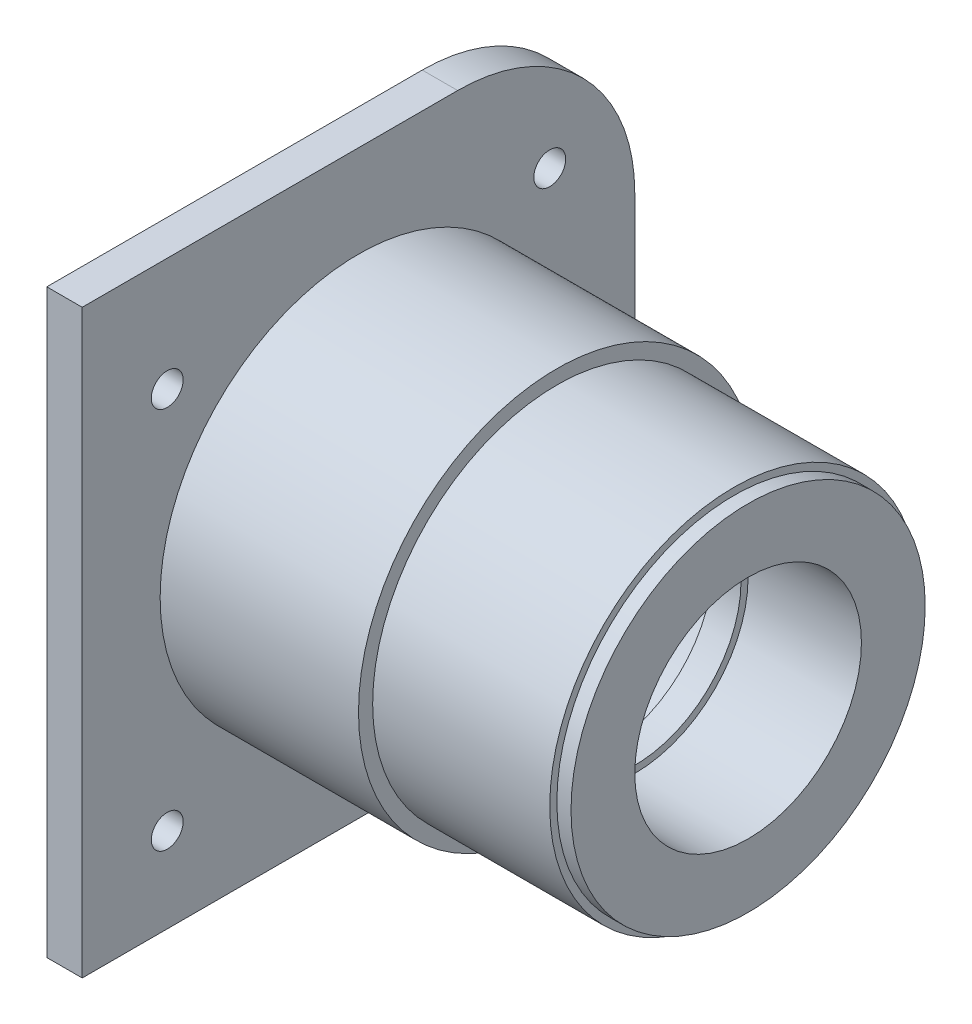
ISO-10303-21;
HEADER;
FILE_DESCRIPTION(('STEP AP214'),'2;1');
FILE_NAME('part.step','',(''),(''),'','','');
FILE_SCHEMA(('AUTOMOTIVE_DESIGN { 1 0 10303 214 1 1 1 1 }'));
ENDSEC;
DATA;
#1=APPLICATION_CONTEXT('core data for automotive mechanical design processes');
#2=APPLICATION_PROTOCOL_DEFINITION('international standard','automotive_design',2000,#1);
#3=PRODUCT_CONTEXT('',#1,'mechanical');
#4=PRODUCT('Part','Part','',(#3));
#5=PRODUCT_RELATED_PRODUCT_CATEGORY('part','',(#4));
#6=PRODUCT_DEFINITION_FORMATION('','',#4);
#7=PRODUCT_DEFINITION_CONTEXT('part definition',#1,'design');
#8=PRODUCT_DEFINITION('design','',#6,#7);
#9=PRODUCT_DEFINITION_SHAPE('','',#8);
#10=(LENGTH_UNIT() NAMED_UNIT(*) SI_UNIT(.MILLI.,.METRE.));
#11=(NAMED_UNIT(*) PLANE_ANGLE_UNIT() SI_UNIT($,.RADIAN.));
#12=(NAMED_UNIT(*) SI_UNIT($,.STERADIAN.) SOLID_ANGLE_UNIT());
#13=UNCERTAINTY_MEASURE_WITH_UNIT(LENGTH_MEASURE(1.E-05),#10,'distance_accuracy_value','');
#14=(GEOMETRIC_REPRESENTATION_CONTEXT(3) GLOBAL_UNCERTAINTY_ASSIGNED_CONTEXT((#13)) GLOBAL_UNIT_ASSIGNED_CONTEXT((#10,
#11,#12)) REPRESENTATION_CONTEXT('',''));
#15=CARTESIAN_POINT('',(0.,0.,0.));
#16=DIRECTION('',(0.,0.,1.));
#17=DIRECTION('',(1.,0.,0.));
#18=AXIS2_PLACEMENT_3D('',#15,#16,#17);
#19=CARTESIAN_POINT('',(-5.,-21.,-21.));
#20=DIRECTION('',(0.,1.,0.));
#21=DIRECTION('',(0.,0.,1.));
#22=AXIS2_PLACEMENT_3D('',#19,#20,#21);
#23=PLANE('',#22);
#24=DIRECTION('',(0.,0.,1.));
#25=VECTOR('',#24,1.);
#26=CARTESIAN_POINT('',(0.,-21.,-21.));
#27=LINE('',#26,#25);
#28=CARTESIAN_POINT('',(0.,-21.,-18.));
#29=VERTEX_POINT('',#28);
#30=CARTESIAN_POINT('',(0.,-21.,0.));
#31=VERTEX_POINT('',#30);
#32=EDGE_CURVE('E253',#29,#31,#27,.T.);
#33=ORIENTED_EDGE('',*,*,#32,.F.);
#34=DIRECTION('',(1.,0.,0.));
#35=VECTOR('',#34,1.);
#36=CARTESIAN_POINT('',(-5.,-21.,-18.));
#37=LINE('',#36,#35);
#38=CARTESIAN_POINT('',(-5.,-21.,-18.));
#39=VERTEX_POINT('',#38);
#40=EDGE_CURVE('E172',#39,#29,#37,.T.);
#41=ORIENTED_EDGE('',*,*,#40,.F.);
#42=DIRECTION('',(0.,0.,1.));
#43=VECTOR('',#42,1.);
#44=CARTESIAN_POINT('',(-5.,-21.,-21.));
#45=LINE('',#44,#43);
#46=CARTESIAN_POINT('',(-5.,-21.,18.));
#47=VERTEX_POINT('',#46);
#48=EDGE_CURVE('E243',#39,#47,#45,.T.);
#49=ORIENTED_EDGE('',*,*,#48,.T.);
#50=DIRECTION('',(1.,0.,0.));
#51=VECTOR('',#50,1.);
#52=CARTESIAN_POINT('',(-5.,-21.,18.));
#53=LINE('',#52,#51);
#54=CARTESIAN_POINT('',(0.,-21.,18.));
#55=VERTEX_POINT('',#54);
#56=EDGE_CURVE('E185',#47,#55,#53,.T.);
#57=ORIENTED_EDGE('',*,*,#56,.T.);
#58=EDGE_CURVE('E248',#31,#55,#27,.T.);
#59=ORIENTED_EDGE('',*,*,#58,.F.);
#60=EDGE_LOOP('',(#33,#41,#49,#57,#59));
#61=FACE_BOUND('',#60,.T.);
#62=ADVANCED_FACE('F36',(#61),#23,.T.);
#63=CARTESIAN_POINT('',(-5.,-21.,-21.));
#64=DIRECTION('',(0.,0.,1.));
#65=DIRECTION('',(0.,-1.,0.));
#66=AXIS2_PLACEMENT_3D('',#63,#64,#65);
#67=PLANE('',#66);
#68=DIRECTION('',(0.,-1.,0.));
#69=VECTOR('',#68,1.);
#70=CARTESIAN_POINT('',(-5.,-21.,-21.));
#71=LINE('',#70,#69);
#72=CARTESIAN_POINT('',(-5.,18.,-21.));
#73=VERTEX_POINT('',#72);
#74=CARTESIAN_POINT('',(-5.,-18.,-21.));
#75=VERTEX_POINT('',#74);
#76=EDGE_CURVE('E168',#73,#75,#71,.T.);
#77=ORIENTED_EDGE('',*,*,#76,.T.);
#78=DIRECTION('',(1.,0.,0.));
#79=VECTOR('',#78,1.);
#80=CARTESIAN_POINT('',(-5.,-18.,-21.));
#81=LINE('',#80,#79);
#82=CARTESIAN_POINT('',(0.,-18.,-21.));
#83=VERTEX_POINT('',#82);
#84=EDGE_CURVE('E165',#75,#83,#81,.T.);
#85=ORIENTED_EDGE('',*,*,#84,.T.);
#86=DIRECTION('',(0.,-1.,0.));
#87=VECTOR('',#86,1.);
#88=CARTESIAN_POINT('',(0.,-21.,-21.));
#89=LINE('',#88,#87);
#90=CARTESIAN_POINT('',(0.,0.,-21.));
#91=VERTEX_POINT('',#90);
#92=EDGE_CURVE('E150',#91,#83,#89,.T.);
#93=ORIENTED_EDGE('',*,*,#92,.F.);
#94=CARTESIAN_POINT('',(0.,18.,-21.));
#95=VERTEX_POINT('',#94);
#96=EDGE_CURVE('E161',#95,#91,#89,.T.);
#97=ORIENTED_EDGE('',*,*,#96,.F.);
#98=DIRECTION('',(1.,0.,0.));
#99=VECTOR('',#98,1.);
#100=CARTESIAN_POINT('',(-5.,18.,-21.));
#101=LINE('',#100,#99);
#102=EDGE_CURVE('E211',#73,#95,#101,.T.);
#103=ORIENTED_EDGE('',*,*,#102,.F.);
#104=EDGE_LOOP('',(#77,#85,#93,#97,#103));
#105=FACE_BOUND('',#104,.T.);
#106=ADVANCED_FACE('F166',(#105),#67,.T.);
#107=CARTESIAN_POINT('',(0.,28.,0.));
#108=DIRECTION('',(1.,0.,0.));
#109=DIRECTION('',(0.,0.,-1.));
#110=AXIS2_PLACEMENT_3D('',#107,#108,#109);
#111=PLANE('',#110);
#112=DIRECTION('',(0.,0.707106781186546,-0.707106781186549));
#113=VECTOR('',#112,1.);
#114=CARTESIAN_POINT('',(0.,-18.,-21.));
#115=LINE('',#114,#113);
#116=EDGE_CURVE('E154',#29,#83,#115,.T.);
#117=ORIENTED_EDGE('',*,*,#116,.F.);
#118=ORIENTED_EDGE('',*,*,#32,.T.);
#119=CARTESIAN_POINT('',(0.,0.,0.));
#120=DIRECTION('',(-1.,0.,0.));
#121=DIRECTION('',(0.,0.,1.));
#122=AXIS2_PLACEMENT_3D('',#119,#120,#121);
#123=CIRCLE('',#122,21.);
#124=EDGE_CURVE('E157',#91,#31,#123,.T.);
#125=ORIENTED_EDGE('',*,*,#124,.F.);
#126=ORIENTED_EDGE('',*,*,#92,.T.);
#127=EDGE_LOOP('',(#117,#118,#125,#126));
#128=FACE_BOUND('',#127,.T.);
#129=ADVANCED_FACE('F152',(#128),#111,.F.);
#130=CARTESIAN_POINT('',(-5.,-21.,21.));
#131=DIRECTION('',(0.,0.,-1.));
#132=DIRECTION('',(0.,1.,0.));
#133=AXIS2_PLACEMENT_3D('',#130,#131,#132);
#134=PLANE('',#133);
#135=DIRECTION('',(0.,1.,0.));
#136=VECTOR('',#135,1.);
#137=CARTESIAN_POINT('',(0.,-21.,21.));
#138=LINE('',#137,#136);
#139=CARTESIAN_POINT('',(0.,-18.,21.));
#140=VERTEX_POINT('',#139);
#141=CARTESIAN_POINT('',(0.,0.,21.));
#142=VERTEX_POINT('',#141);
#143=EDGE_CURVE('E246',#140,#142,#138,.T.);
#144=ORIENTED_EDGE('',*,*,#143,.F.);
#145=DIRECTION('',(1.,0.,0.));
#146=VECTOR('',#145,1.);
#147=CARTESIAN_POINT('',(-5.,-18.,21.));
#148=LINE('',#147,#146);
#149=CARTESIAN_POINT('',(-5.,-18.,21.));
#150=VERTEX_POINT('',#149);
#151=EDGE_CURVE('E189',#150,#140,#148,.T.);
#152=ORIENTED_EDGE('',*,*,#151,.F.);
#153=DIRECTION('',(0.,1.,0.));
#154=VECTOR('',#153,1.);
#155=CARTESIAN_POINT('',(-5.,-21.,21.));
#156=LINE('',#155,#154);
#157=CARTESIAN_POINT('',(-5.,18.,21.));
#158=VERTEX_POINT('',#157);
#159=EDGE_CURVE('E238',#150,#158,#156,.T.);
#160=ORIENTED_EDGE('',*,*,#159,.T.);
#161=DIRECTION('',(1.,0.,0.));
#162=VECTOR('',#161,1.);
#163=CARTESIAN_POINT('',(-5.,18.,21.));
#164=LINE('',#163,#162);
#165=CARTESIAN_POINT('',(0.,18.,21.));
#166=VERTEX_POINT('',#165);
#167=EDGE_CURVE('E196',#158,#166,#164,.T.);
#168=ORIENTED_EDGE('',*,*,#167,.T.);
#169=EDGE_CURVE('E249',#142,#166,#138,.T.);
#170=ORIENTED_EDGE('',*,*,#169,.F.);
#171=EDGE_LOOP('',(#144,#152,#160,#168,#170));
#172=FACE_BOUND('',#171,.T.);
#173=ADVANCED_FACE('F380',(#172),#134,.T.);
#174=DIRECTION('',(0.,-0.707106781186548,-0.707106781186547));
#175=VECTOR('',#174,1.);
#176=CARTESIAN_POINT('',(0.,-18.,21.));
#177=LINE('',#176,#175);
#178=EDGE_CURVE('E181',#140,#55,#177,.T.);
#179=ORIENTED_EDGE('',*,*,#178,.F.);
#180=ORIENTED_EDGE('',*,*,#143,.T.);
#181=EDGE_CURVE('E310',#31,#142,#123,.T.);
#182=ORIENTED_EDGE('',*,*,#181,.F.);
#183=ORIENTED_EDGE('',*,*,#58,.T.);
#184=EDGE_LOOP('',(#179,#180,#182,#183));
#185=FACE_BOUND('',#184,.T.);
#186=ADVANCED_FACE('F378',(#185),#111,.F.);
#187=CARTESIAN_POINT('',(-5.,21.,-21.));
#188=DIRECTION('',(0.,-1.,0.));
#189=DIRECTION('',(0.,0.,-1.));
#190=AXIS2_PLACEMENT_3D('',#187,#188,#189);
#191=PLANE('',#190);
#192=DIRECTION('',(0.,0.,-1.));
#193=VECTOR('',#192,1.);
#194=CARTESIAN_POINT('',(0.,21.,-21.));
#195=LINE('',#194,#193);
#196=CARTESIAN_POINT('',(0.,21.,18.));
#197=VERTEX_POINT('',#196);
#198=CARTESIAN_POINT('',(0.,21.,0.));
#199=VERTEX_POINT('',#198);
#200=EDGE_CURVE('E250',#197,#199,#195,.T.);
#201=ORIENTED_EDGE('',*,*,#200,.F.);
#202=DIRECTION('',(1.,0.,0.));
#203=VECTOR('',#202,1.);
#204=CARTESIAN_POINT('',(-5.,21.,18.));
#205=LINE('',#204,#203);
#206=CARTESIAN_POINT('',(-5.,21.,18.));
#207=VERTEX_POINT('',#206);
#208=EDGE_CURVE('E200',#207,#197,#205,.T.);
#209=ORIENTED_EDGE('',*,*,#208,.F.);
#210=DIRECTION('',(0.,0.,-1.));
#211=VECTOR('',#210,1.);
#212=CARTESIAN_POINT('',(-5.,21.,-21.));
#213=LINE('',#212,#211);
#214=CARTESIAN_POINT('',(-5.,21.,-18.));
#215=VERTEX_POINT('',#214);
#216=EDGE_CURVE('E240',#207,#215,#213,.T.);
#217=ORIENTED_EDGE('',*,*,#216,.T.);
#218=DIRECTION('',(1.,0.,0.));
#219=VECTOR('',#218,1.);
#220=CARTESIAN_POINT('',(-5.,21.,-18.));
#221=LINE('',#220,#219);
#222=CARTESIAN_POINT('',(0.,21.,-18.));
#223=VERTEX_POINT('',#222);
#224=EDGE_CURVE('E207',#215,#223,#221,.T.);
#225=ORIENTED_EDGE('',*,*,#224,.T.);
#226=EDGE_CURVE('E251',#199,#223,#195,.T.);
#227=ORIENTED_EDGE('',*,*,#226,.F.);
#228=EDGE_LOOP('',(#201,#209,#217,#225,#227));
#229=FACE_BOUND('',#228,.T.);
#230=ADVANCED_FACE('F374',(#229),#191,.T.);
#231=DIRECTION('',(0.,-0.707106781186547,0.707106781186547));
#232=VECTOR('',#231,1.);
#233=CARTESIAN_POINT('',(0.,18.,21.));
#234=LINE('',#233,#232);
#235=EDGE_CURVE('E192',#197,#166,#234,.T.);
#236=ORIENTED_EDGE('',*,*,#235,.F.);
#237=ORIENTED_EDGE('',*,*,#200,.T.);
#238=EDGE_CURVE('E162',#142,#199,#123,.T.);
#239=ORIENTED_EDGE('',*,*,#238,.F.);
#240=ORIENTED_EDGE('',*,*,#169,.T.);
#241=EDGE_LOOP('',(#236,#237,#239,#240));
#242=FACE_BOUND('',#241,.T.);
#243=ADVANCED_FACE('F377',(#242),#111,.F.);
#244=DIRECTION('',(0.,0.707106781186548,0.707106781186547));
#245=VECTOR('',#244,1.);
#246=CARTESIAN_POINT('',(0.,18.,-21.));
#247=LINE('',#246,#245);
#248=EDGE_CURVE('E203',#95,#223,#247,.T.);
#249=ORIENTED_EDGE('',*,*,#248,.F.);
#250=ORIENTED_EDGE('',*,*,#96,.T.);
#251=EDGE_CURVE('E313',#199,#91,#123,.T.);
#252=ORIENTED_EDGE('',*,*,#251,.F.);
#253=ORIENTED_EDGE('',*,*,#226,.T.);
#254=EDGE_LOOP('',(#249,#250,#252,#253));
#255=FACE_BOUND('',#254,.T.);
#256=ADVANCED_FACE('F386',(#255),#111,.F.);
#257=CARTESIAN_POINT('',(-5.,0.,0.));
#258=DIRECTION('',(1.,0.,0.));
#259=DIRECTION('',(0.,0.,-1.));
#260=AXIS2_PLACEMENT_3D('',#257,#258,#259);
#261=PLANE('',#260);
#262=ORIENTED_EDGE('',*,*,#48,.F.);
#263=DIRECTION('',(0.,0.707106781186546,-0.707106781186549));
#264=VECTOR('',#263,1.);
#265=CARTESIAN_POINT('',(-5.,-18.,-21.));
#266=LINE('',#265,#264);
#267=EDGE_CURVE('E173',#39,#75,#266,.T.);
#268=ORIENTED_EDGE('',*,*,#267,.T.);
#269=ORIENTED_EDGE('',*,*,#76,.F.);
#270=DIRECTION('',(0.,0.707106781186548,0.707106781186547));
#271=VECTOR('',#270,1.);
#272=CARTESIAN_POINT('',(-5.,18.,-21.));
#273=LINE('',#272,#271);
#274=EDGE_CURVE('E204',#73,#215,#273,.T.);
#275=ORIENTED_EDGE('',*,*,#274,.T.);
#276=ORIENTED_EDGE('',*,*,#216,.F.);
#277=DIRECTION('',(0.,-0.707106781186547,0.707106781186547));
#278=VECTOR('',#277,1.);
#279=CARTESIAN_POINT('',(-5.,18.,21.));
#280=LINE('',#279,#278);
#281=EDGE_CURVE('E193',#207,#158,#280,.T.);
#282=ORIENTED_EDGE('',*,*,#281,.T.);
#283=ORIENTED_EDGE('',*,*,#159,.F.);
#284=DIRECTION('',(0.,-0.707106781186548,-0.707106781186547));
#285=VECTOR('',#284,1.);
#286=CARTESIAN_POINT('',(-5.,-18.,21.));
#287=LINE('',#286,#285);
#288=EDGE_CURVE('E182',#150,#47,#287,.T.);
#289=ORIENTED_EDGE('',*,*,#288,.T.);
#290=EDGE_LOOP('',(#262,#268,#269,#275,#276,#282,#283,#289));
#291=FACE_BOUND('',#290,.T.);
#292=DIRECTION('',(0.,-1.,0.));
#293=VECTOR('',#292,1.);
#294=CARTESIAN_POINT('',(-5.,-41.,-39.));
#295=LINE('',#294,#293);
#296=CARTESIAN_POINT('',(-5.,16.,-39.));
#297=VERTEX_POINT('',#296);
#298=CARTESIAN_POINT('',(-5.,-16.,-39.));
#299=VERTEX_POINT('',#298);
#300=EDGE_CURVE('E262',#297,#299,#295,.T.);
#301=ORIENTED_EDGE('',*,*,#300,.T.);
#302=CARTESIAN_POINT('',(-5.,-16.,-14.));
#303=DIRECTION('',(1.,0.,0.));
#304=DIRECTION('',(0.,0.,-1.));
#305=AXIS2_PLACEMENT_3D('',#302,#303,#304);
#306=CIRCLE('',#305,25.);
#307=CARTESIAN_POINT('',(-5.,-41.,-14.));
#308=VERTEX_POINT('',#307);
#309=EDGE_CURVE('E44',#299,#308,#306,.F.);
#310=ORIENTED_EDGE('',*,*,#309,.T.);
#311=DIRECTION('',(0.,0.,1.));
#312=VECTOR('',#311,1.);
#313=CARTESIAN_POINT('',(-5.,-41.,-39.));
#314=LINE('',#313,#312);
#315=CARTESIAN_POINT('',(-5.,-41.,39.));
#316=VERTEX_POINT('',#315);
#317=EDGE_CURVE('E264',#308,#316,#314,.T.);
#318=ORIENTED_EDGE('',*,*,#317,.T.);
#319=DIRECTION('',(0.,1.,0.));
#320=VECTOR('',#319,1.);
#321=CARTESIAN_POINT('',(-5.,-41.,39.));
#322=LINE('',#321,#320);
#323=CARTESIAN_POINT('',(-5.,41.,39.));
#324=VERTEX_POINT('',#323);
#325=EDGE_CURVE('E256',#316,#324,#322,.T.);
#326=ORIENTED_EDGE('',*,*,#325,.T.);
#327=DIRECTION('',(0.,0.,-1.));
#328=VECTOR('',#327,1.);
#329=CARTESIAN_POINT('',(-5.,41.,-39.));
#330=LINE('',#329,#328);
#331=CARTESIAN_POINT('',(-5.,41.,-14.));
#332=VERTEX_POINT('',#331);
#333=EDGE_CURVE('E259',#324,#332,#330,.T.);
#334=ORIENTED_EDGE('',*,*,#333,.T.);
#335=CARTESIAN_POINT('',(-5.,16.,-14.));
#336=DIRECTION('',(1.,0.,0.));
#337=DIRECTION('',(0.,0.,-1.));
#338=AXIS2_PLACEMENT_3D('',#335,#336,#337);
#339=CIRCLE('',#338,25.);
#340=EDGE_CURVE('E326',#332,#297,#339,.F.);
#341=ORIENTED_EDGE('',*,*,#340,.T.);
#342=EDGE_LOOP('',(#301,#310,#318,#326,#334,#341));
#343=FACE_BOUND('',#342,.T.);
#344=CARTESIAN_POINT('',(-5.,-29.,-27.));
#345=DIRECTION('',(-1.,0.,0.));
#346=DIRECTION('',(0.,0.,1.));
#347=AXIS2_PLACEMENT_3D('',#344,#345,#346);
#348=CIRCLE('',#347,2.24999999999999);
#349=CARTESIAN_POINT('',(-5.,-29.,-24.75));
#350=VERTEX_POINT('',#349);
#351=EDGE_CURVE('E232',#350,#350,#348,.T.);
#352=ORIENTED_EDGE('',*,*,#351,.F.);
#353=EDGE_LOOP('',(#352));
#354=FACE_BOUND('',#353,.T.);
#355=CARTESIAN_POINT('',(-5.,-29.,27.));
#356=DIRECTION('',(-1.,0.,0.));
#357=DIRECTION('',(0.,0.,1.));
#358=AXIS2_PLACEMENT_3D('',#355,#356,#357);
#359=CIRCLE('',#358,2.24999999999999);
#360=CARTESIAN_POINT('',(-5.,-29.,29.25));
#361=VERTEX_POINT('',#360);
#362=EDGE_CURVE('E226',#361,#361,#359,.T.);
#363=ORIENTED_EDGE('',*,*,#362,.F.);
#364=EDGE_LOOP('',(#363));
#365=FACE_BOUND('',#364,.T.);
#366=CARTESIAN_POINT('',(-5.,25.,27.));
#367=DIRECTION('',(-1.,0.,0.));
#368=DIRECTION('',(0.,0.,1.));
#369=AXIS2_PLACEMENT_3D('',#366,#367,#368);
#370=CIRCLE('',#369,2.24999999999999);
#371=CARTESIAN_POINT('',(-5.,25.,29.25));
#372=VERTEX_POINT('',#371);
#373=EDGE_CURVE('E220',#372,#372,#370,.T.);
#374=ORIENTED_EDGE('',*,*,#373,.F.);
#375=EDGE_LOOP('',(#374));
#376=FACE_BOUND('',#375,.T.);
#377=CARTESIAN_POINT('',(-5.,25.,-27.));
#378=DIRECTION('',(-1.,0.,0.));
#379=DIRECTION('',(0.,0.,1.));
#380=AXIS2_PLACEMENT_3D('',#377,#378,#379);
#381=CIRCLE('',#380,2.24999999999999);
#382=CARTESIAN_POINT('',(-5.,25.,-24.75));
#383=VERTEX_POINT('',#382);
#384=EDGE_CURVE('E214',#383,#383,#381,.T.);
#385=ORIENTED_EDGE('',*,*,#384,.F.);
#386=EDGE_LOOP('',(#385));
#387=FACE_BOUND('',#386,.T.);
#388=ADVANCED_FACE('F330',(#291,#343,#354,#365,#376,#387),#261,.F.);
#389=CARTESIAN_POINT('',(55.,16.,0.));
#390=DIRECTION('',(-1.,0.,0.));
#391=DIRECTION('',(0.,0.,1.));
#392=AXIS2_PLACEMENT_3D('',#389,#390,#391);
#393=PLANE('',#392);
#394=CARTESIAN_POINT('',(55.,0.,0.));
#395=DIRECTION('',(-1.,0.,0.));
#396=DIRECTION('',(0.,0.,1.));
#397=AXIS2_PLACEMENT_3D('',#394,#395,#396);
#398=CIRCLE('',#397,16.);
#399=CARTESIAN_POINT('',(55.,0.,16.));
#400=VERTEX_POINT('',#399);
#401=EDGE_CURVE('E295',#400,#400,#398,.T.);
#402=ORIENTED_EDGE('',*,*,#401,.T.);
#403=EDGE_LOOP('',(#402));
#404=FACE_BOUND('',#403,.T.);
#405=CARTESIAN_POINT('',(55.,0.,0.));
#406=DIRECTION('',(1.,0.,0.));
#407=DIRECTION('',(0.,0.,-1.));
#408=AXIS2_PLACEMENT_3D('',#405,#406,#407);
#409=CIRCLE('',#408,25.);
#410=CARTESIAN_POINT('',(55.,0.,-25.));
#411=VERTEX_POINT('',#410);
#412=EDGE_CURVE('E280',#411,#411,#409,.T.);
#413=ORIENTED_EDGE('',*,*,#412,.T.);
#414=EDGE_LOOP('',(#413));
#415=FACE_BOUND('',#414,.T.);
#416=ADVANCED_FACE('F385',(#404,#415),#393,.F.);
#417=CARTESIAN_POINT('',(-64.1033524540557,0.,0.));
#418=DIRECTION('',(-1.,0.,0.));
#419=DIRECTION('',(0.,0.,1.));
#420=AXIS2_PLACEMENT_3D('',#417,#418,#419);
#421=CYLINDRICAL_SURFACE('',#420,26.);
#422=CARTESIAN_POINT('',(28.,0.,0.));
#423=DIRECTION('',(-1.,0.,0.));
#424=DIRECTION('',(0.,0.,1.));
#425=AXIS2_PLACEMENT_3D('',#422,#423,#424);
#426=CIRCLE('',#425,26.);
#427=CARTESIAN_POINT('',(28.,0.,26.));
#428=VERTEX_POINT('',#427);
#429=EDGE_CURVE('E292',#428,#428,#426,.T.);
#430=ORIENTED_EDGE('',*,*,#429,.F.);
#431=EDGE_LOOP('',(#430));
#432=FACE_BOUND('',#431,.T.);
#433=CARTESIAN_POINT('',(53.,0.,0.));
#434=DIRECTION('',(1.,0.,0.));
#435=DIRECTION('',(0.,0.,-1.));
#436=AXIS2_PLACEMENT_3D('',#433,#434,#435);
#437=CIRCLE('',#436,26.);
#438=CARTESIAN_POINT('',(53.,0.,-26.));
#439=VERTEX_POINT('',#438);
#440=EDGE_CURVE('E283',#439,#439,#437,.T.);
#441=ORIENTED_EDGE('',*,*,#440,.F.);
#442=EDGE_LOOP('',(#441));
#443=FACE_BOUND('',#442,.T.);
#444=ADVANCED_FACE('F584',(#432,#443),#421,.T.);
#445=CARTESIAN_POINT('',(-64.1033524540557,0.,0.));
#446=DIRECTION('',(-1.,0.,0.));
#447=DIRECTION('',(0.,0.,1.));
#448=AXIS2_PLACEMENT_3D('',#445,#446,#447);
#449=CYLINDRICAL_SURFACE('',#448,21.);
#450=CARTESIAN_POINT('',(35.,0.,0.));
#451=DIRECTION('',(-1.,0.,0.));
#452=DIRECTION('',(0.,0.,1.));
#453=AXIS2_PLACEMENT_3D('',#450,#451,#452);
#454=CIRCLE('',#453,21.);
#455=CARTESIAN_POINT('',(35.,0.,21.));
#456=VERTEX_POINT('',#455);
#457=EDGE_CURVE('E307',#456,#456,#454,.T.);
#458=ORIENTED_EDGE('',*,*,#457,.F.);
#459=EDGE_LOOP('',(#458));
#460=FACE_BOUND('',#459,.T.);
#461=ORIENTED_EDGE('',*,*,#238,.T.);
#462=ORIENTED_EDGE('',*,*,#251,.T.);
#463=ORIENTED_EDGE('',*,*,#124,.T.);
#464=ORIENTED_EDGE('',*,*,#181,.T.);
#465=EDGE_LOOP('',(#461,#462,#463,#464));
#466=FACE_BOUND('',#465,.T.);
#467=ADVANCED_FACE('F593',(#460,#466),#449,.F.);
#468=CARTESIAN_POINT('',(35.,21.,0.));
#469=DIRECTION('',(1.,0.,0.));
#470=DIRECTION('',(0.,0.,-1.));
#471=AXIS2_PLACEMENT_3D('',#468,#469,#470);
#472=PLANE('',#471);
#473=CARTESIAN_POINT('',(35.,0.,0.));
#474=DIRECTION('',(-1.,0.,0.));
#475=DIRECTION('',(0.,0.,1.));
#476=AXIS2_PLACEMENT_3D('',#473,#474,#475);
#477=CIRCLE('',#476,15.);
#478=CARTESIAN_POINT('',(35.,0.,15.));
#479=VERTEX_POINT('',#478);
#480=EDGE_CURVE('E304',#479,#479,#477,.T.);
#481=ORIENTED_EDGE('',*,*,#480,.F.);
#482=EDGE_LOOP('',(#481));
#483=FACE_BOUND('',#482,.T.);
#484=ORIENTED_EDGE('',*,*,#457,.T.);
#485=EDGE_LOOP('',(#484));
#486=FACE_BOUND('',#485,.T.);
#487=ADVANCED_FACE('F602',(#483,#486),#472,.F.);
#488=CARTESIAN_POINT('',(-64.1033524540557,0.,0.));
#489=DIRECTION('',(-1.,0.,0.));
#490=DIRECTION('',(0.,0.,1.));
#491=AXIS2_PLACEMENT_3D('',#488,#489,#490);
#492=CYLINDRICAL_SURFACE('',#491,15.);
#493=CARTESIAN_POINT('',(39.,0.,0.));
#494=DIRECTION('',(-1.,0.,0.));
#495=DIRECTION('',(0.,0.,1.));
#496=AXIS2_PLACEMENT_3D('',#493,#494,#495);
#497=CIRCLE('',#496,15.);
#498=CARTESIAN_POINT('',(39.,0.,15.));
#499=VERTEX_POINT('',#498);
#500=EDGE_CURVE('E301',#499,#499,#497,.T.);
#501=ORIENTED_EDGE('',*,*,#500,.F.);
#502=EDGE_LOOP('',(#501));
#503=FACE_BOUND('',#502,.T.);
#504=ORIENTED_EDGE('',*,*,#480,.T.);
#505=EDGE_LOOP('',(#504));
#506=FACE_BOUND('',#505,.T.);
#507=ADVANCED_FACE('F611',(#503,#506),#492,.F.);
#508=CARTESIAN_POINT('',(39.,15.,0.));
#509=DIRECTION('',(-1.,0.,0.));
#510=DIRECTION('',(0.,0.,1.));
#511=AXIS2_PLACEMENT_3D('',#508,#509,#510);
#512=PLANE('',#511);
#513=CARTESIAN_POINT('',(39.,0.,0.));
#514=DIRECTION('',(-1.,0.,0.));
#515=DIRECTION('',(0.,0.,1.));
#516=AXIS2_PLACEMENT_3D('',#513,#514,#515);
#517=CIRCLE('',#516,16.);
#518=CARTESIAN_POINT('',(39.,0.,16.));
#519=VERTEX_POINT('',#518);
#520=EDGE_CURVE('E298',#519,#519,#517,.T.);
#521=ORIENTED_EDGE('',*,*,#520,.F.);
#522=EDGE_LOOP('',(#521));
#523=FACE_BOUND('',#522,.T.);
#524=ORIENTED_EDGE('',*,*,#500,.T.);
#525=EDGE_LOOP('',(#524));
#526=FACE_BOUND('',#525,.T.);
#527=ADVANCED_FACE('F619',(#523,#526),#512,.F.);
#528=CARTESIAN_POINT('',(-64.1033524540557,0.,0.));
#529=DIRECTION('',(-1.,0.,0.));
#530=DIRECTION('',(0.,0.,1.));
#531=AXIS2_PLACEMENT_3D('',#528,#529,#530);
#532=CYLINDRICAL_SURFACE('',#531,16.);
#533=ORIENTED_EDGE('',*,*,#401,.F.);
#534=EDGE_LOOP('',(#533));
#535=FACE_BOUND('',#534,.T.);
#536=ORIENTED_EDGE('',*,*,#520,.T.);
#537=EDGE_LOOP('',(#536));
#538=FACE_BOUND('',#537,.T.);
#539=ADVANCED_FACE('F627',(#535,#538),#532,.F.);
#540=CARTESIAN_POINT('',(28.,26.,0.));
#541=DIRECTION('',(-1.,0.,0.));
#542=DIRECTION('',(0.,0.,1.));
#543=AXIS2_PLACEMENT_3D('',#540,#541,#542);
#544=PLANE('',#543);
#545=CARTESIAN_POINT('',(28.,0.,0.));
#546=DIRECTION('',(-1.,0.,0.));
#547=DIRECTION('',(0.,0.,1.));
#548=AXIS2_PLACEMENT_3D('',#545,#546,#547);
#549=CIRCLE('',#548,28.);
#550=CARTESIAN_POINT('',(28.,0.,28.));
#551=VERTEX_POINT('',#550);
#552=EDGE_CURVE('E289',#551,#551,#549,.T.);
#553=ORIENTED_EDGE('',*,*,#552,.F.);
#554=EDGE_LOOP('',(#553));
#555=FACE_BOUND('',#554,.T.);
#556=ORIENTED_EDGE('',*,*,#429,.T.);
#557=EDGE_LOOP('',(#556));
#558=FACE_BOUND('',#557,.T.);
#559=ADVANCED_FACE('F635',(#555,#558),#544,.F.);
#560=CARTESIAN_POINT('',(-64.1033524540557,0.,0.));
#561=DIRECTION('',(-1.,0.,0.));
#562=DIRECTION('',(0.,0.,1.));
#563=AXIS2_PLACEMENT_3D('',#560,#561,#562);
#564=CYLINDRICAL_SURFACE('',#563,28.);
#565=CARTESIAN_POINT('',(0.,0.,0.));
#566=DIRECTION('',(-1.,0.,0.));
#567=DIRECTION('',(0.,0.,1.));
#568=AXIS2_PLACEMENT_3D('',#565,#566,#567);
#569=CIRCLE('',#568,28.);
#570=CARTESIAN_POINT('',(0.,0.,28.));
#571=VERTEX_POINT('',#570);
#572=EDGE_CURVE('E286',#571,#571,#569,.T.);
#573=ORIENTED_EDGE('',*,*,#572,.F.);
#574=EDGE_LOOP('',(#573));
#575=FACE_BOUND('',#574,.T.);
#576=ORIENTED_EDGE('',*,*,#552,.T.);
#577=EDGE_LOOP('',(#576));
#578=FACE_BOUND('',#577,.T.);
#579=ADVANCED_FACE('F642',(#575,#578),#564,.T.);
#580=CARTESIAN_POINT('',(53.,0.,0.));
#581=DIRECTION('',(1.,0.,0.));
#582=DIRECTION('',(0.,0.,-1.));
#583=AXIS2_PLACEMENT_3D('',#580,#581,#582);
#584=PLANE('',#583);
#585=CARTESIAN_POINT('',(53.,0.,0.));
#586=DIRECTION('',(1.,0.,0.));
#587=DIRECTION('',(0.,0.,-1.));
#588=AXIS2_PLACEMENT_3D('',#585,#586,#587);
#589=CIRCLE('',#588,25.);
#590=CARTESIAN_POINT('',(53.,0.,-25.));
#591=VERTEX_POINT('',#590);
#592=EDGE_CURVE('E279',#591,#591,#589,.T.);
#593=ORIENTED_EDGE('',*,*,#592,.F.);
#594=EDGE_LOOP('',(#593));
#595=FACE_BOUND('',#594,.T.);
#596=ORIENTED_EDGE('',*,*,#440,.T.);
#597=EDGE_LOOP('',(#596));
#598=FACE_BOUND('',#597,.T.);
#599=ADVANCED_FACE('F649',(#595,#598),#584,.T.);
#600=CARTESIAN_POINT('',(55.,0.,0.));
#601=DIRECTION('',(-1.,0.,0.));
#602=DIRECTION('',(0.,0.,1.));
#603=AXIS2_PLACEMENT_3D('',#600,#601,#602);
#604=CYLINDRICAL_SURFACE('',#603,25.);
#605=ORIENTED_EDGE('',*,*,#412,.F.);
#606=EDGE_LOOP('',(#605));
#607=FACE_BOUND('',#606,.T.);
#608=ORIENTED_EDGE('',*,*,#592,.T.);
#609=EDGE_LOOP('',(#608));
#610=FACE_BOUND('',#609,.T.);
#611=ADVANCED_FACE('F359',(#607,#610),#604,.T.);
#612=CARTESIAN_POINT('',(0.,0.,0.));
#613=DIRECTION('',(1.,0.,0.));
#614=DIRECTION('',(0.,0.,-1.));
#615=AXIS2_PLACEMENT_3D('',#612,#613,#614);
#616=PLANE('',#615);
#617=ORIENTED_EDGE('',*,*,#572,.T.);
#618=EDGE_LOOP('',(#617));
#619=FACE_BOUND('',#618,.T.);
#620=CARTESIAN_POINT('',(0.,25.,-27.));
#621=DIRECTION('',(1.,0.,0.));
#622=DIRECTION('',(0.,0.,-1.));
#623=AXIS2_PLACEMENT_3D('',#620,#621,#622);
#624=CIRCLE('',#623,2.24999999999999);
#625=CARTESIAN_POINT('',(0.,25.,-29.25));
#626=VERTEX_POINT('',#625);
#627=EDGE_CURVE('E217',#626,#626,#624,.T.);
#628=ORIENTED_EDGE('',*,*,#627,.F.);
#629=EDGE_LOOP('',(#628));
#630=FACE_BOUND('',#629,.T.);
#631=CARTESIAN_POINT('',(0.,25.,27.));
#632=DIRECTION('',(1.,0.,0.));
#633=DIRECTION('',(0.,0.,-1.));
#634=AXIS2_PLACEMENT_3D('',#631,#632,#633);
#635=CIRCLE('',#634,2.24999999999999);
#636=CARTESIAN_POINT('',(0.,25.,24.75));
#637=VERTEX_POINT('',#636);
#638=EDGE_CURVE('E223',#637,#637,#635,.T.);
#639=ORIENTED_EDGE('',*,*,#638,.F.);
#640=EDGE_LOOP('',(#639));
#641=FACE_BOUND('',#640,.T.);
#642=CARTESIAN_POINT('',(0.,-29.,27.));
#643=DIRECTION('',(1.,0.,0.));
#644=DIRECTION('',(0.,0.,-1.));
#645=AXIS2_PLACEMENT_3D('',#642,#643,#644);
#646=CIRCLE('',#645,2.24999999999999);
#647=CARTESIAN_POINT('',(0.,-29.,24.75));
#648=VERTEX_POINT('',#647);
#649=EDGE_CURVE('E229',#648,#648,#646,.T.);
#650=ORIENTED_EDGE('',*,*,#649,.F.);
#651=EDGE_LOOP('',(#650));
#652=FACE_BOUND('',#651,.T.);
#653=CARTESIAN_POINT('',(0.,-29.,-27.));
#654=DIRECTION('',(1.,0.,0.));
#655=DIRECTION('',(0.,0.,-1.));
#656=AXIS2_PLACEMENT_3D('',#653,#654,#655);
#657=CIRCLE('',#656,2.24999999999999);
#658=CARTESIAN_POINT('',(0.,-29.,-29.25));
#659=VERTEX_POINT('',#658);
#660=EDGE_CURVE('E235',#659,#659,#657,.T.);
#661=ORIENTED_EDGE('',*,*,#660,.F.);
#662=EDGE_LOOP('',(#661));
#663=FACE_BOUND('',#662,.T.);
#664=DIRECTION('',(0.,0.,1.));
#665=VECTOR('',#664,1.);
#666=CARTESIAN_POINT('',(0.,-41.,-39.));
#667=LINE('',#666,#665);
#668=CARTESIAN_POINT('',(0.,-41.,-14.));
#669=VERTEX_POINT('',#668);
#670=CARTESIAN_POINT('',(0.,-41.,39.));
#671=VERTEX_POINT('',#670);
#672=EDGE_CURVE('E260',#669,#671,#667,.T.);
#673=ORIENTED_EDGE('',*,*,#672,.F.);
#674=CARTESIAN_POINT('',(0.,-16.,-14.));
#675=DIRECTION('',(1.,0.,0.));
#676=DIRECTION('',(0.,0.,-1.));
#677=AXIS2_PLACEMENT_3D('',#674,#675,#676);
#678=CIRCLE('',#677,25.);
#679=CARTESIAN_POINT('',(0.,-16.,-39.));
#680=VERTEX_POINT('',#679);
#681=EDGE_CURVE('E320',#669,#680,#678,.T.);
#682=ORIENTED_EDGE('',*,*,#681,.T.);
#683=DIRECTION('',(0.,-1.,0.));
#684=VECTOR('',#683,1.);
#685=CARTESIAN_POINT('',(0.,-41.,-39.));
#686=LINE('',#685,#684);
#687=CARTESIAN_POINT('',(0.,16.,-39.));
#688=VERTEX_POINT('',#687);
#689=EDGE_CURVE('E271',#688,#680,#686,.T.);
#690=ORIENTED_EDGE('',*,*,#689,.F.);
#691=CARTESIAN_POINT('',(0.,16.,-14.));
#692=DIRECTION('',(1.,0.,0.));
#693=DIRECTION('',(0.,0.,-1.));
#694=AXIS2_PLACEMENT_3D('',#691,#692,#693);
#695=CIRCLE('',#694,25.);
#696=CARTESIAN_POINT('',(0.,41.,-14.));
#697=VERTEX_POINT('',#696);
#698=EDGE_CURVE('E318',#688,#697,#695,.T.);
#699=ORIENTED_EDGE('',*,*,#698,.T.);
#700=DIRECTION('',(0.,0.,-1.));
#701=VECTOR('',#700,1.);
#702=CARTESIAN_POINT('',(0.,41.,-39.));
#703=LINE('',#702,#701);
#704=CARTESIAN_POINT('',(0.,41.,39.));
#705=VERTEX_POINT('',#704);
#706=EDGE_CURVE('E269',#705,#697,#703,.T.);
#707=ORIENTED_EDGE('',*,*,#706,.F.);
#708=DIRECTION('',(0.,1.,0.));
#709=VECTOR('',#708,1.);
#710=CARTESIAN_POINT('',(0.,-41.,39.));
#711=LINE('',#710,#709);
#712=EDGE_CURVE('E245',#671,#705,#711,.T.);
#713=ORIENTED_EDGE('',*,*,#712,.F.);
#714=EDGE_LOOP('',(#673,#682,#690,#699,#707,#713));
#715=FACE_BOUND('',#714,.T.);
#716=ADVANCED_FACE('F342',(#619,#630,#641,#652,#663,#715),#616,.T.);
#717=CARTESIAN_POINT('',(-5.,-41.,39.));
#718=DIRECTION('',(0.,0.,-1.));
#719=DIRECTION('',(0.,1.,0.));
#720=AXIS2_PLACEMENT_3D('',#717,#718,#719);
#721=PLANE('',#720);
#722=ORIENTED_EDGE('',*,*,#712,.T.);
#723=DIRECTION('',(1.,0.,0.));
#724=VECTOR('',#723,1.);
#725=CARTESIAN_POINT('',(-5.,41.,39.));
#726=LINE('',#725,#724);
#727=EDGE_CURVE('E276',#324,#705,#726,.T.);
#728=ORIENTED_EDGE('',*,*,#727,.F.);
#729=ORIENTED_EDGE('',*,*,#325,.F.);
#730=DIRECTION('',(1.,0.,0.));
#731=VECTOR('',#730,1.);
#732=CARTESIAN_POINT('',(-5.,-41.,39.));
#733=LINE('',#732,#731);
#734=EDGE_CURVE('E266',#316,#671,#733,.T.);
#735=ORIENTED_EDGE('',*,*,#734,.T.);
#736=EDGE_LOOP('',(#722,#728,#729,#735));
#737=FACE_BOUND('',#736,.T.);
#738=ADVANCED_FACE('F351',(#737),#721,.F.);
#739=CARTESIAN_POINT('',(-5.,41.,-39.));
#740=DIRECTION('',(0.,-1.,0.));
#741=DIRECTION('',(0.,0.,-1.));
#742=AXIS2_PLACEMENT_3D('',#739,#740,#741);
#743=PLANE('',#742);
#744=ORIENTED_EDGE('',*,*,#706,.T.);
#745=DIRECTION('',(1.,0.,0.));
#746=VECTOR('',#745,1.);
#747=CARTESIAN_POINT('',(-5.,41.,-14.));
#748=LINE('',#747,#746);
#749=EDGE_CURVE('E11',#697,#332,#748,.F.);
#750=ORIENTED_EDGE('',*,*,#749,.T.);
#751=ORIENTED_EDGE('',*,*,#333,.F.);
#752=ORIENTED_EDGE('',*,*,#727,.T.);
#753=EDGE_LOOP('',(#744,#750,#751,#752));
#754=FACE_BOUND('',#753,.T.);
#755=ADVANCED_FACE('F348',(#754),#743,.F.);
#756=CARTESIAN_POINT('',(-5.,-41.,-39.));
#757=DIRECTION('',(0.,0.,1.));
#758=DIRECTION('',(1.,0.,0.));
#759=AXIS2_PLACEMENT_3D('',#756,#757,#758);
#760=PLANE('',#759);
#761=ORIENTED_EDGE('',*,*,#689,.T.);
#762=DIRECTION('',(1.,0.,0.));
#763=VECTOR('',#762,1.);
#764=CARTESIAN_POINT('',(-5.,-16.,-39.));
#765=LINE('',#764,#763);
#766=EDGE_CURVE('E57',#680,#299,#765,.F.);
#767=ORIENTED_EDGE('',*,*,#766,.T.);
#768=ORIENTED_EDGE('',*,*,#300,.F.);
#769=DIRECTION('',(1.,0.,0.));
#770=VECTOR('',#769,1.);
#771=CARTESIAN_POINT('',(-5.,16.,-39.));
#772=LINE('',#771,#770);
#773=EDGE_CURVE('E322',#297,#688,#772,.T.);
#774=ORIENTED_EDGE('',*,*,#773,.T.);
#775=EDGE_LOOP('',(#761,#767,#768,#774));
#776=FACE_BOUND('',#775,.T.);
#777=ADVANCED_FACE('F344',(#776),#760,.F.);
#778=CARTESIAN_POINT('',(-5.,-41.,-39.));
#779=DIRECTION('',(0.,1.,0.));
#780=DIRECTION('',(0.,0.,1.));
#781=AXIS2_PLACEMENT_3D('',#778,#779,#780);
#782=PLANE('',#781);
#783=ORIENTED_EDGE('',*,*,#317,.F.);
#784=DIRECTION('',(1.,0.,0.));
#785=VECTOR('',#784,1.);
#786=CARTESIAN_POINT('',(-5.,-41.,-14.));
#787=LINE('',#786,#785);
#788=EDGE_CURVE('E255',#308,#669,#787,.T.);
#789=ORIENTED_EDGE('',*,*,#788,.T.);
#790=ORIENTED_EDGE('',*,*,#672,.T.);
#791=ORIENTED_EDGE('',*,*,#734,.F.);
#792=EDGE_LOOP('',(#783,#789,#790,#791));
#793=FACE_BOUND('',#792,.T.);
#794=ADVANCED_FACE('F336',(#793),#782,.F.);
#795=CARTESIAN_POINT('',(-5.,-29.,-27.));
#796=DIRECTION('',(-1.,0.,0.));
#797=DIRECTION('',(0.,0.,1.));
#798=AXIS2_PLACEMENT_3D('',#795,#796,#797);
#799=CYLINDRICAL_SURFACE('',#798,2.24999999999999);
#800=ORIENTED_EDGE('',*,*,#351,.T.);
#801=EDGE_LOOP('',(#800));
#802=FACE_BOUND('',#801,.T.);
#803=ORIENTED_EDGE('',*,*,#660,.T.);
#804=EDGE_LOOP('',(#803));
#805=FACE_BOUND('',#804,.T.);
#806=ADVANCED_FACE('F371',(#802,#805),#799,.F.);
#807=CARTESIAN_POINT('',(-5.,-29.,27.));
#808=DIRECTION('',(-1.,0.,0.));
#809=DIRECTION('',(0.,0.,1.));
#810=AXIS2_PLACEMENT_3D('',#807,#808,#809);
#811=CYLINDRICAL_SURFACE('',#810,2.24999999999999);
#812=ORIENTED_EDGE('',*,*,#362,.T.);
#813=EDGE_LOOP('',(#812));
#814=FACE_BOUND('',#813,.T.);
#815=ORIENTED_EDGE('',*,*,#649,.T.);
#816=EDGE_LOOP('',(#815));
#817=FACE_BOUND('',#816,.T.);
#818=ADVANCED_FACE('F407',(#814,#817),#811,.F.);
#819=CARTESIAN_POINT('',(-5.,25.,27.));
#820=DIRECTION('',(-1.,0.,0.));
#821=DIRECTION('',(0.,0.,1.));
#822=AXIS2_PLACEMENT_3D('',#819,#820,#821);
#823=CYLINDRICAL_SURFACE('',#822,2.24999999999999);
#824=ORIENTED_EDGE('',*,*,#373,.T.);
#825=EDGE_LOOP('',(#824));
#826=FACE_BOUND('',#825,.T.);
#827=ORIENTED_EDGE('',*,*,#638,.T.);
#828=EDGE_LOOP('',(#827));
#829=FACE_BOUND('',#828,.T.);
#830=ADVANCED_FACE('F414',(#826,#829),#823,.F.);
#831=CARTESIAN_POINT('',(-5.,25.,-27.));
#832=DIRECTION('',(-1.,0.,0.));
#833=DIRECTION('',(0.,0.,1.));
#834=AXIS2_PLACEMENT_3D('',#831,#832,#833);
#835=CYLINDRICAL_SURFACE('',#834,2.24999999999999);
#836=ORIENTED_EDGE('',*,*,#384,.T.);
#837=EDGE_LOOP('',(#836));
#838=FACE_BOUND('',#837,.T.);
#839=ORIENTED_EDGE('',*,*,#627,.T.);
#840=EDGE_LOOP('',(#839));
#841=FACE_BOUND('',#840,.T.);
#842=ADVANCED_FACE('F421',(#838,#841),#835,.F.);
#843=CARTESIAN_POINT('',(-5.,18.,-21.));
#844=DIRECTION('',(0.,0.707106781186547,-0.707106781186548));
#845=DIRECTION('',(0.,0.707106781186548,0.707106781186547));
#846=AXIS2_PLACEMENT_3D('',#843,#844,#845);
#847=PLANE('',#846);
#848=ORIENTED_EDGE('',*,*,#248,.T.);
#849=ORIENTED_EDGE('',*,*,#224,.F.);
#850=ORIENTED_EDGE('',*,*,#274,.F.);
#851=ORIENTED_EDGE('',*,*,#102,.T.);
#852=EDGE_LOOP('',(#848,#849,#850,#851));
#853=FACE_BOUND('',#852,.T.);
#854=ADVANCED_FACE('F429',(#853),#847,.F.);
#855=CARTESIAN_POINT('',(-5.,18.,21.));
#856=DIRECTION('',(0.,0.707106781186548,0.707106781186548));
#857=DIRECTION('',(0.,-0.707106781186548,0.707106781186548));
#858=AXIS2_PLACEMENT_3D('',#855,#856,#857);
#859=PLANE('',#858);
#860=ORIENTED_EDGE('',*,*,#235,.T.);
#861=ORIENTED_EDGE('',*,*,#167,.F.);
#862=ORIENTED_EDGE('',*,*,#281,.F.);
#863=ORIENTED_EDGE('',*,*,#208,.T.);
#864=EDGE_LOOP('',(#860,#861,#862,#863));
#865=FACE_BOUND('',#864,.T.);
#866=ADVANCED_FACE('F437',(#865),#859,.F.);
#867=CARTESIAN_POINT('',(-5.,-18.,21.));
#868=DIRECTION('',(0.,-0.707106781186547,0.707106781186548));
#869=DIRECTION('',(0.,-0.707106781186548,-0.707106781186547));
#870=AXIS2_PLACEMENT_3D('',#867,#868,#869);
#871=PLANE('',#870);
#872=ORIENTED_EDGE('',*,*,#178,.T.);
#873=ORIENTED_EDGE('',*,*,#56,.F.);
#874=ORIENTED_EDGE('',*,*,#288,.F.);
#875=ORIENTED_EDGE('',*,*,#151,.T.);
#876=EDGE_LOOP('',(#872,#873,#874,#875));
#877=FACE_BOUND('',#876,.T.);
#878=ADVANCED_FACE('F446',(#877),#871,.F.);
#879=CARTESIAN_POINT('',(-5.,-18.,-21.));
#880=DIRECTION('',(0.,-0.707106781186549,-0.707106781186546));
#881=DIRECTION('',(0.,0.707106781186546,-0.707106781186549));
#882=AXIS2_PLACEMENT_3D('',#879,#880,#881);
#883=PLANE('',#882);
#884=ORIENTED_EDGE('',*,*,#116,.T.);
#885=ORIENTED_EDGE('',*,*,#84,.F.);
#886=ORIENTED_EDGE('',*,*,#267,.F.);
#887=ORIENTED_EDGE('',*,*,#40,.T.);
#888=EDGE_LOOP('',(#884,#885,#886,#887));
#889=FACE_BOUND('',#888,.T.);
#890=ADVANCED_FACE('F176',(#889),#883,.F.);
#891=CARTESIAN_POINT('',(-5.,-16.,-14.));
#892=DIRECTION('',(1.,0.,0.));
#893=DIRECTION('',(0.,0.,-1.));
#894=AXIS2_PLACEMENT_3D('',#891,#892,#893);
#895=CYLINDRICAL_SURFACE('',#894,25.);
#896=ORIENTED_EDGE('',*,*,#309,.F.);
#897=ORIENTED_EDGE('',*,*,#766,.F.);
#898=ORIENTED_EDGE('',*,*,#681,.F.);
#899=ORIENTED_EDGE('',*,*,#788,.F.);
#900=EDGE_LOOP('',(#896,#897,#898,#899));
#901=FACE_BOUND('',#900,.T.);
#902=ADVANCED_FACE('F339',(#901),#895,.T.);
#903=CARTESIAN_POINT('',(-5.,16.,-14.));
#904=DIRECTION('',(1.,0.,0.));
#905=DIRECTION('',(0.,0.,-1.));
#906=AXIS2_PLACEMENT_3D('',#903,#904,#905);
#907=CYLINDRICAL_SURFACE('',#906,25.);
#908=ORIENTED_EDGE('',*,*,#340,.F.);
#909=ORIENTED_EDGE('',*,*,#749,.F.);
#910=ORIENTED_EDGE('',*,*,#698,.F.);
#911=ORIENTED_EDGE('',*,*,#773,.F.);
#912=EDGE_LOOP('',(#908,#909,#910,#911));
#913=FACE_BOUND('',#912,.T.);
#914=ADVANCED_FACE('F38',(#913),#907,.T.);
#915=CLOSED_SHELL('',(#62,#106,#129,#173,#186,#230,#243,#256,#388,#416,#444,#467,#487,#507,#527,
#539,#559,#579,#599,#611,#716,#738,#755,#777,#794,#806,#818,#830,#842,#854,#866,#878,#890,#902,#914));
#916=MANIFOLD_SOLID_BREP('B2',#915);
#917=ADVANCED_BREP_SHAPE_REPRESENTATION('',(#18,#916),#14);
#918=SHAPE_DEFINITION_REPRESENTATION(#9,#917);
ENDSEC;
END-ISO-10303-21;
